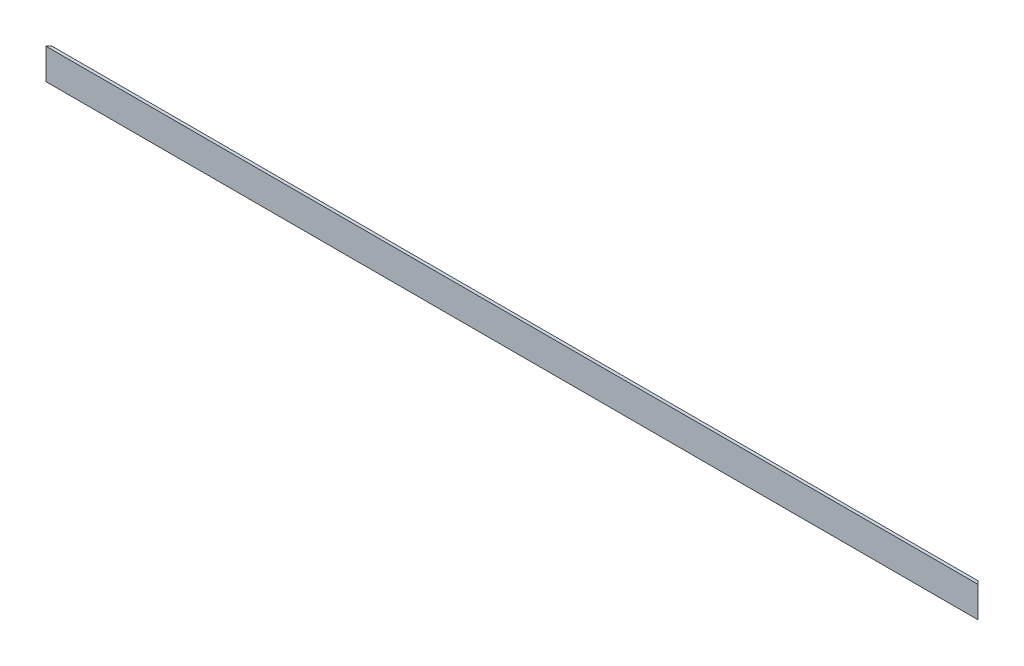
ISO-10303-21;
HEADER;
FILE_DESCRIPTION(('STEP AP214'),'2;1');
FILE_NAME('part.step','',(''),(''),'','','');
FILE_SCHEMA(('AUTOMOTIVE_DESIGN { 1 0 10303 214 1 1 1 1 }'));
ENDSEC;
DATA;
#1=APPLICATION_CONTEXT('core data for automotive mechanical design processes');
#2=APPLICATION_PROTOCOL_DEFINITION('international standard','automotive_design',2000,#1);
#3=PRODUCT_CONTEXT('',#1,'mechanical');
#4=PRODUCT('Part','Part','',(#3));
#5=PRODUCT_RELATED_PRODUCT_CATEGORY('part','',(#4));
#6=PRODUCT_DEFINITION_FORMATION('','',#4);
#7=PRODUCT_DEFINITION_CONTEXT('part definition',#1,'design');
#8=PRODUCT_DEFINITION('design','',#6,#7);
#9=PRODUCT_DEFINITION_SHAPE('','',#8);
#10=(LENGTH_UNIT() NAMED_UNIT(*) SI_UNIT(.MILLI.,.METRE.));
#11=(NAMED_UNIT(*) PLANE_ANGLE_UNIT() SI_UNIT($,.RADIAN.));
#12=(NAMED_UNIT(*) SI_UNIT($,.STERADIAN.) SOLID_ANGLE_UNIT());
#13=UNCERTAINTY_MEASURE_WITH_UNIT(LENGTH_MEASURE(1.E-05),#10,'distance_accuracy_value','');
#14=(GEOMETRIC_REPRESENTATION_CONTEXT(3) GLOBAL_UNCERTAINTY_ASSIGNED_CONTEXT((#13)) GLOBAL_UNIT_ASSIGNED_CONTEXT((#10,
#11,#12)) REPRESENTATION_CONTEXT('',''));
#15=CARTESIAN_POINT('',(0.,0.,0.));
#16=DIRECTION('',(0.,0.,1.));
#17=DIRECTION('',(1.,0.,0.));
#18=AXIS2_PLACEMENT_3D('',#15,#16,#17);
#19=CARTESIAN_POINT('',(455.,0.,-15.));
#20=DIRECTION('',(0.,1.,0.));
#21=DIRECTION('',(0.,0.,1.));
#22=AXIS2_PLACEMENT_3D('',#19,#20,#21);
#23=PLANE('',#22);
#24=DIRECTION('',(0.707106781186551,0.,-0.707106781186544));
#25=VECTOR('',#24,1.);
#26=CARTESIAN_POINT('',(0.,0.,0.));
#27=LINE('',#26,#25);
#28=CARTESIAN_POINT('',(0.,0.,0.));
#29=VERTEX_POINT('',#28);
#30=CARTESIAN_POINT('',(15.0000000000001,0.,-15.));
#31=VERTEX_POINT('',#30);
#32=EDGE_CURVE('E91',#29,#31,#27,.T.);
#33=ORIENTED_EDGE('',*,*,#32,.T.);
#34=DIRECTION('',(-1.,0.,0.));
#35=VECTOR('',#34,1.);
#36=CARTESIAN_POINT('',(455.,0.,-15.));
#37=LINE('',#36,#35);
#38=CARTESIAN_POINT('',(440.,0.,-15.));
#39=VERTEX_POINT('',#38);
#40=EDGE_CURVE('E11',#39,#31,#37,.T.);
#41=ORIENTED_EDGE('',*,*,#40,.F.);
#42=DIRECTION('',(-0.707106781186551,0.,-0.707106781186544));
#43=VECTOR('',#42,1.);
#44=CARTESIAN_POINT('',(455.,0.,0.));
#45=LINE('',#44,#43);
#46=CARTESIAN_POINT('',(455.,0.,0.));
#47=VERTEX_POINT('',#46);
#48=EDGE_CURVE('E131',#47,#39,#45,.T.);
#49=ORIENTED_EDGE('',*,*,#48,.F.);
#50=DIRECTION('',(-1.,0.,0.));
#51=VECTOR('',#50,1.);
#52=CARTESIAN_POINT('',(455.,0.,0.));
#53=LINE('',#52,#51);
#54=EDGE_CURVE('E109',#47,#29,#53,.T.);
#55=ORIENTED_EDGE('',*,*,#54,.T.);
#56=EDGE_LOOP('',(#33,#41,#49,#55));
#57=FACE_BOUND('',#56,.T.);
#58=ADVANCED_FACE('F38',(#57),#23,.F.);
#59=CARTESIAN_POINT('',(455.,1.49999999999998,-15.));
#60=DIRECTION('',(0.,0.,1.));
#61=DIRECTION('',(1.,0.,0.));
#62=AXIS2_PLACEMENT_3D('',#59,#60,#61);
#63=PLANE('',#62);
#64=DIRECTION('',(0.,-1.,0.));
#65=VECTOR('',#64,1.);
#66=CARTESIAN_POINT('',(15.0000000000001,1.4999999999995,-15.));
#67=LINE('',#66,#65);
#68=CARTESIAN_POINT('',(15.0000000000001,1.49999999999998,-15.));
#69=VERTEX_POINT('',#68);
#70=EDGE_CURVE('E130',#69,#31,#67,.T.);
#71=ORIENTED_EDGE('',*,*,#70,.F.);
#72=DIRECTION('',(-1.,0.,0.));
#73=VECTOR('',#72,1.);
#74=CARTESIAN_POINT('',(455.,1.49999999999998,-15.));
#75=LINE('',#74,#73);
#76=CARTESIAN_POINT('',(440.,1.49999999999998,-15.));
#77=VERTEX_POINT('',#76);
#78=EDGE_CURVE('E46',#77,#69,#75,.T.);
#79=ORIENTED_EDGE('',*,*,#78,.F.);
#80=DIRECTION('',(0.,-1.,0.));
#81=VECTOR('',#80,1.);
#82=CARTESIAN_POINT('',(440.,1.5,-15.));
#83=LINE('',#82,#81);
#84=EDGE_CURVE('E97',#77,#39,#83,.T.);
#85=ORIENTED_EDGE('',*,*,#84,.T.);
#86=ORIENTED_EDGE('',*,*,#40,.T.);
#87=EDGE_LOOP('',(#71,#79,#85,#86));
#88=FACE_BOUND('',#87,.T.);
#89=ADVANCED_FACE('F128',(#88),#63,.F.);
#90=CARTESIAN_POINT('',(455.,1.5,-1.50000000000002));
#91=DIRECTION('',(0.,-1.,0.));
#92=DIRECTION('',(0.,0.,-1.));
#93=AXIS2_PLACEMENT_3D('',#90,#91,#92);
#94=PLANE('',#93);
#95=DIRECTION('',(0.707106781186551,0.,-0.707106781186544));
#96=VECTOR('',#95,1.);
#97=CARTESIAN_POINT('',(228.250000000002,1.49999999999972,-228.25));
#98=LINE('',#97,#96);
#99=CARTESIAN_POINT('',(1.49999999999998,1.5,-1.50000000000002));
#100=VERTEX_POINT('',#99);
#101=EDGE_CURVE('E123',#100,#69,#98,.T.);
#102=ORIENTED_EDGE('',*,*,#101,.F.);
#103=DIRECTION('',(-1.,0.,0.));
#104=VECTOR('',#103,1.);
#105=CARTESIAN_POINT('',(455.,1.5,-1.50000000000002));
#106=LINE('',#105,#104);
#107=CARTESIAN_POINT('',(453.5,1.5,-1.50000000000002));
#108=VERTEX_POINT('',#107);
#109=EDGE_CURVE('E111',#108,#100,#106,.T.);
#110=ORIENTED_EDGE('',*,*,#109,.F.);
#111=DIRECTION('',(-0.707106781186551,0.,-0.707106781186544));
#112=VECTOR('',#111,1.);
#113=CARTESIAN_POINT('',(454.25,1.5,-0.750000000000004));
#114=LINE('',#113,#112);
#115=EDGE_CURVE('E124',#108,#77,#114,.T.);
#116=ORIENTED_EDGE('',*,*,#115,.T.);
#117=ORIENTED_EDGE('',*,*,#78,.T.);
#118=EDGE_LOOP('',(#102,#110,#116,#117));
#119=FACE_BOUND('',#118,.T.);
#120=ADVANCED_FACE('F121',(#119),#94,.F.);
#121=CARTESIAN_POINT('',(455.,15.,-1.5));
#122=DIRECTION('',(0.,0.,1.));
#123=DIRECTION('',(0.,-1.,0.));
#124=AXIS2_PLACEMENT_3D('',#121,#122,#123);
#125=PLANE('',#124);
#126=DIRECTION('',(0.,-1.,0.));
#127=VECTOR('',#126,1.);
#128=CARTESIAN_POINT('',(1.49999999999995,14.9999999999987,-1.5));
#129=LINE('',#128,#127);
#130=CARTESIAN_POINT('',(1.50000000000001,15.,-1.50000000000002));
#131=VERTEX_POINT('',#130);
#132=EDGE_CURVE('E106',#131,#100,#129,.T.);
#133=ORIENTED_EDGE('',*,*,#132,.F.);
#134=DIRECTION('',(-1.,0.,0.));
#135=VECTOR('',#134,1.);
#136=CARTESIAN_POINT('',(455.,15.,-1.5));
#137=LINE('',#136,#135);
#138=CARTESIAN_POINT('',(453.5,15.,-1.5));
#139=VERTEX_POINT('',#138);
#140=EDGE_CURVE('E105',#139,#131,#137,.T.);
#141=ORIENTED_EDGE('',*,*,#140,.F.);
#142=DIRECTION('',(0.,-1.,0.));
#143=VECTOR('',#142,1.);
#144=CARTESIAN_POINT('',(453.5,15.,-1.5));
#145=LINE('',#144,#143);
#146=EDGE_CURVE('E137',#139,#108,#145,.T.);
#147=ORIENTED_EDGE('',*,*,#146,.T.);
#148=ORIENTED_EDGE('',*,*,#109,.T.);
#149=EDGE_LOOP('',(#133,#141,#147,#148));
#150=FACE_BOUND('',#149,.T.);
#151=ADVANCED_FACE('F148',(#150),#125,.F.);
#152=CARTESIAN_POINT('',(455.,15.,0.));
#153=DIRECTION('',(0.,-1.,0.));
#154=DIRECTION('',(0.,0.,-1.));
#155=AXIS2_PLACEMENT_3D('',#152,#153,#154);
#156=PLANE('',#155);
#157=DIRECTION('',(0.707106781186551,0.,-0.707106781186544));
#158=VECTOR('',#157,1.);
#159=CARTESIAN_POINT('',(0.,15.,0.));
#160=LINE('',#159,#158);
#161=CARTESIAN_POINT('',(0.,15.,0.));
#162=VERTEX_POINT('',#161);
#163=EDGE_CURVE('E88',#162,#131,#160,.T.);
#164=ORIENTED_EDGE('',*,*,#163,.F.);
#165=DIRECTION('',(-1.,0.,0.));
#166=VECTOR('',#165,1.);
#167=CARTESIAN_POINT('',(455.,15.,0.));
#168=LINE('',#167,#166);
#169=CARTESIAN_POINT('',(455.,15.,0.));
#170=VERTEX_POINT('',#169);
#171=EDGE_CURVE('E102',#170,#162,#168,.T.);
#172=ORIENTED_EDGE('',*,*,#171,.F.);
#173=DIRECTION('',(-0.707106781186551,0.,-0.707106781186544));
#174=VECTOR('',#173,1.);
#175=CARTESIAN_POINT('',(455.,15.,0.));
#176=LINE('',#175,#174);
#177=EDGE_CURVE('E52',#170,#139,#176,.T.);
#178=ORIENTED_EDGE('',*,*,#177,.T.);
#179=ORIENTED_EDGE('',*,*,#140,.T.);
#180=EDGE_LOOP('',(#164,#172,#178,#179));
#181=FACE_BOUND('',#180,.T.);
#182=ADVANCED_FACE('F101',(#181),#156,.F.);
#183=CARTESIAN_POINT('',(455.,0.,0.));
#184=DIRECTION('',(0.,0.,-1.));
#185=DIRECTION('',(-1.,0.,0.));
#186=AXIS2_PLACEMENT_3D('',#183,#184,#185);
#187=PLANE('',#186);
#188=DIRECTION('',(0.,-1.,0.));
#189=VECTOR('',#188,1.);
#190=CARTESIAN_POINT('',(0.,0.,0.));
#191=LINE('',#190,#189);
#192=EDGE_CURVE('E85',#162,#29,#191,.T.);
#193=ORIENTED_EDGE('',*,*,#192,.T.);
#194=ORIENTED_EDGE('',*,*,#54,.F.);
#195=DIRECTION('',(0.,-1.,0.));
#196=VECTOR('',#195,1.);
#197=CARTESIAN_POINT('',(455.,0.,0.));
#198=LINE('',#197,#196);
#199=EDGE_CURVE('E96',#170,#47,#198,.T.);
#200=ORIENTED_EDGE('',*,*,#199,.F.);
#201=ORIENTED_EDGE('',*,*,#171,.T.);
#202=EDGE_LOOP('',(#193,#194,#200,#201));
#203=FACE_BOUND('',#202,.T.);
#204=ADVANCED_FACE('F108',(#203),#187,.F.);
#205=CARTESIAN_POINT('',(455.,15.,0.));
#206=DIRECTION('',(-0.707106781186544,0.,0.707106781186551));
#207=DIRECTION('',(0.707106781186551,0.,0.707106781186544));
#208=AXIS2_PLACEMENT_3D('',#205,#206,#207);
#209=PLANE('',#208);
#210=ORIENTED_EDGE('',*,*,#115,.F.);
#211=ORIENTED_EDGE('',*,*,#146,.F.);
#212=ORIENTED_EDGE('',*,*,#177,.F.);
#213=ORIENTED_EDGE('',*,*,#199,.T.);
#214=ORIENTED_EDGE('',*,*,#48,.T.);
#215=ORIENTED_EDGE('',*,*,#84,.F.);
#216=EDGE_LOOP('',(#210,#211,#212,#213,#214,#215));
#217=FACE_BOUND('',#216,.T.);
#218=ADVANCED_FACE('F144',(#217),#209,.F.);
#219=CARTESIAN_POINT('',(0.,15.,0.));
#220=DIRECTION('',(-0.707106781186544,0.,-0.707106781186551));
#221=DIRECTION('',(-0.707106781186551,0.,0.707106781186544));
#222=AXIS2_PLACEMENT_3D('',#219,#220,#221);
#223=PLANE('',#222);
#224=ORIENTED_EDGE('',*,*,#70,.T.);
#225=ORIENTED_EDGE('',*,*,#32,.F.);
#226=ORIENTED_EDGE('',*,*,#192,.F.);
#227=ORIENTED_EDGE('',*,*,#163,.T.);
#228=ORIENTED_EDGE('',*,*,#132,.T.);
#229=ORIENTED_EDGE('',*,*,#101,.T.);
#230=EDGE_LOOP('',(#224,#225,#226,#227,#228,#229));
#231=FACE_BOUND('',#230,.T.);
#232=ADVANCED_FACE('F87',(#231),#223,.T.);
#233=CLOSED_SHELL('',(#58,#89,#120,#151,#182,#204,#218,#232));
#234=MANIFOLD_SOLID_BREP('B2',#233);
#235=ADVANCED_BREP_SHAPE_REPRESENTATION('',(#18,#234),#14);
#236=SHAPE_DEFINITION_REPRESENTATION(#9,#235);
ENDSEC;
END-ISO-10303-21;
